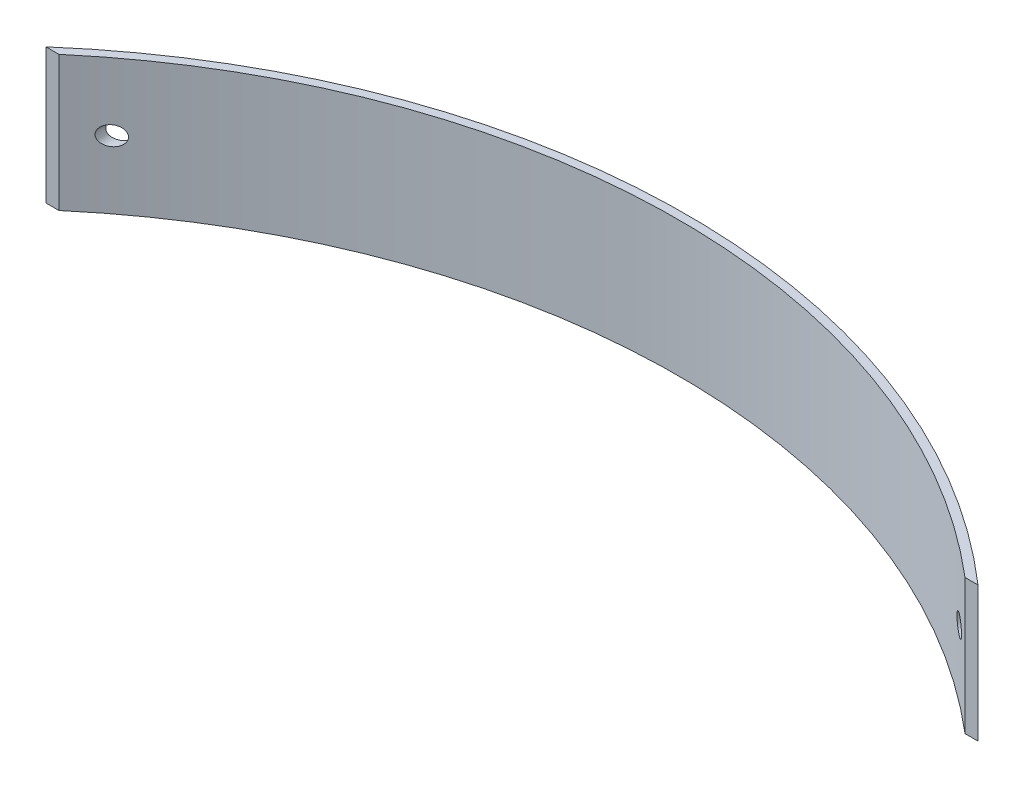
ISO-10303-21;
HEADER;
FILE_DESCRIPTION(('STEP AP214'),'2;1');
FILE_NAME('part.step','',(''),(''),'','','');
FILE_SCHEMA(('AUTOMOTIVE_DESIGN { 1 0 10303 214 1 1 1 1 }'));
ENDSEC;
DATA;
#1=APPLICATION_CONTEXT('core data for automotive mechanical design processes');
#2=APPLICATION_PROTOCOL_DEFINITION('international standard','automotive_design',2000,#1);
#3=PRODUCT_CONTEXT('',#1,'mechanical');
#4=PRODUCT('Part','Part','',(#3));
#5=PRODUCT_RELATED_PRODUCT_CATEGORY('part','',(#4));
#6=PRODUCT_DEFINITION_FORMATION('','',#4);
#7=PRODUCT_DEFINITION_CONTEXT('part definition',#1,'design');
#8=PRODUCT_DEFINITION('design','',#6,#7);
#9=PRODUCT_DEFINITION_SHAPE('','',#8);
#10=(LENGTH_UNIT() NAMED_UNIT(*) SI_UNIT(.MILLI.,.METRE.));
#11=(NAMED_UNIT(*) PLANE_ANGLE_UNIT() SI_UNIT($,.RADIAN.));
#12=(NAMED_UNIT(*) SI_UNIT($,.STERADIAN.) SOLID_ANGLE_UNIT());
#13=UNCERTAINTY_MEASURE_WITH_UNIT(LENGTH_MEASURE(1.E-05),#10,'distance_accuracy_value','');
#14=(GEOMETRIC_REPRESENTATION_CONTEXT(3) GLOBAL_UNCERTAINTY_ASSIGNED_CONTEXT((#13)) GLOBAL_UNIT_ASSIGNED_CONTEXT((#10,
#11,#12)) REPRESENTATION_CONTEXT('',''));
#15=CARTESIAN_POINT('',(0.,0.,0.));
#16=DIRECTION('',(0.,0.,1.));
#17=DIRECTION('',(1.,0.,0.));
#18=AXIS2_PLACEMENT_3D('',#15,#16,#17);
#19=CARTESIAN_POINT('',(0.,50.8,200.014733840304));
#20=DIRECTION('',(0.,-1.,0.));
#21=DIRECTION('',(0.,0.,-1.));
#22=AXIS2_PLACEMENT_3D('',#19,#20,#21);
#23=CYLINDRICAL_SURFACE('',#22,265.764733840304);
#24=CARTESIAN_POINT('',(-155.5563,25.4,-15.4687487831157));
#25=CARTESIAN_POINT('',(-155.556300492666,25.4864564692822,-15.4687484361435));
#26=CARTESIAN_POINT('',(-155.559446786538,25.5729224052767,-15.4664772432667));
#27=CARTESIAN_POINT('',(-155.571983694634,25.7451960852808,-15.457426079964));
#28=CARTESIAN_POINT('',(-155.58137727593,25.8310034969352,-15.4506439671327));
#29=CARTESIAN_POINT('',(-155.606283492095,26.0013933947019,-15.432657715201));
#30=CARTESIAN_POINT('',(-155.621805379908,26.085973827096,-15.4214468893071));
#31=CARTESIAN_POINT('',(-155.658724549251,26.2531706444461,-15.3947732347221));
#32=CARTESIAN_POINT('',(-155.680124303861,26.3357861867521,-15.3793086162676));
#33=CARTESIAN_POINT('',(-155.752461644528,26.5789994609958,-15.3270131683004));
#34=CARTESIAN_POINT('',(-155.811686256816,26.7359513991203,-15.2841733427863));
#35=CARTESIAN_POINT('',(-155.949204960864,27.0362440782479,-15.1845839671425));
#36=CARTESIAN_POINT('',(-156.027497151094,27.1795861745238,-15.1278358040294));
#37=CARTESIAN_POINT('',(-156.205736558126,27.459829959612,-14.9984622871658));
#38=CARTESIAN_POINT('',(-156.306784595407,27.5956534861338,-14.9250268760451));
#39=CARTESIAN_POINT('',(-156.523210906955,27.8482705064177,-14.767472448579));
#40=CARTESIAN_POINT('',(-156.638595948182,27.9650549532915,-14.6833483868441));
#41=CARTESIAN_POINT('',(-156.902187399731,28.1983951157675,-14.4908103017378));
#42=CARTESIAN_POINT('',(-157.052564861298,28.3111340074402,-14.3807485496445));
#43=CARTESIAN_POINT('',(-157.364227979453,28.5095803770905,-14.1520959166496));
#44=CARTESIAN_POINT('',(-157.525521002637,28.5952693744414,-14.0334992723045));
#45=CARTESIAN_POINT('',(-157.887385680177,28.7541272354172,-13.7667595049445));
#46=CARTESIAN_POINT('',(-158.089508142109,28.8216445149123,-13.6173470363156));
#47=CARTESIAN_POINT('',(-158.499017837631,28.9196797740796,-13.3136989502886));
#48=CARTESIAN_POINT('',(-158.706407966967,28.9501769330489,-13.1594606687472));
#49=CARTESIAN_POINT('',(-159.15348297875,28.9766232322297,-12.8259378606446));
#50=CARTESIAN_POINT('',(-159.393325509698,28.9666744820022,-12.6463811520886));
#51=CARTESIAN_POINT('',(-159.868420182092,28.8986527879862,-12.2894588696051));
#52=CARTESIAN_POINT('',(-160.103666730049,28.8405245393203,-12.1120960516041));
#53=CARTESIAN_POINT('',(-160.45197747964,28.7152298417313,-11.8486162937348));
#54=CARTESIAN_POINT('',(-160.569431902494,28.6658297950296,-11.7596087989371));
#55=CARTESIAN_POINT('',(-160.800096335792,28.5537513706271,-11.5845189804843));
#56=CARTESIAN_POINT('',(-160.913305564588,28.4910705615895,-11.4984371957981));
#57=CARTESIAN_POINT('',(-161.244318693007,28.2830098955333,-11.2463357140363));
#58=CARTESIAN_POINT('',(-161.454354103497,28.1173166327331,-11.0858193985319));
#59=CARTESIAN_POINT('',(-161.773777858908,27.7982781528683,-10.8410568501752));
#60=CARTESIAN_POINT('',(-161.892993788132,27.6601536121956,-10.7495220207073));
#61=CARTESIAN_POINT('',(-162.112072993346,27.3614202027077,-10.5810602715374));
#62=CARTESIAN_POINT('',(-162.211963761239,27.2008438428177,-10.5041126033775));
#63=CARTESIAN_POINT('',(-162.374144053838,26.8850391089569,-10.3790399451032));
#64=CARTESIAN_POINT('',(-162.439818724271,26.7325801188572,-10.3283285140612));
#65=CARTESIAN_POINT('',(-162.550145156982,26.4159014512975,-10.2430815853404));
#66=CARTESIAN_POINT('',(-162.594805810235,26.2516867815788,-10.2085392465932));
#67=CARTESIAN_POINT('',(-162.660525032129,25.9149949685959,-10.157693302861));
#68=CARTESIAN_POINT('',(-162.681475097475,25.7424835773995,-10.1414735454531));
#69=CARTESIAN_POINT('',(-162.697916353254,25.3955346410063,-10.1287454653869));
#70=CARTESIAN_POINT('',(-162.693414119396,25.2210976049304,-10.1322320515121));
#71=CARTESIAN_POINT('',(-162.660681619083,24.8900724834298,-10.1575686943075));
#72=CARTESIAN_POINT('',(-162.634375097146,24.7331715190418,-10.1779299227368));
#73=CARTESIAN_POINT('',(-162.562059274487,24.4268503459314,-10.2338635555199));
#74=CARTESIAN_POINT('',(-162.516047934352,24.2774309133224,-10.2694375343653));
#75=CARTESIAN_POINT('',(-162.404435624024,23.9834418755384,-10.3556494755955));
#76=CARTESIAN_POINT('',(-162.338125003609,23.8393049999766,-10.4068328356218));
#77=CARTESIAN_POINT('',(-162.189615370314,23.5647482122951,-10.5213229337172));
#78=CARTESIAN_POINT('',(-162.107409790609,23.4343340040479,-10.5846346823937));
#79=CARTESIAN_POINT('',(-161.916580272964,23.1699494351776,-10.7313961842545));
#80=CARTESIAN_POINT('',(-161.805842305563,23.0383987162258,-10.8164427082473));
#81=CARTESIAN_POINT('',(-161.570910341664,22.7958298323173,-10.9965375229457));
#82=CARTESIAN_POINT('',(-161.446707923368,22.6848246371312,-11.091592072428));
#83=CARTESIAN_POINT('',(-161.161478709977,22.4627587610552,-11.3094481482125));
#84=CARTESIAN_POINT('',(-160.998122627716,22.3563520324495,-11.4339430549538));
#85=CARTESIAN_POINT('',(-160.660974350382,22.1730390169892,-11.690226072897));
#86=CARTESIAN_POINT('',(-160.487175675265,22.0961512711188,-11.8220187085676));
#87=CARTESIAN_POINT('',(-160.097768450278,21.9590818243874,-12.1165200342316));
#88=CARTESIAN_POINT('',(-159.880671534095,21.9051808337523,-12.2802019047199));
#89=CARTESIAN_POINT('',(-159.441864153305,21.8384641548132,-12.6099618925717));
#90=CARTESIAN_POINT('',(-159.220149581453,21.8256867656299,-12.7760420990688));
#91=CARTESIAN_POINT('',(-158.751194387016,21.8423080284962,-13.1261753906039));
#92=CARTESIAN_POINT('',(-158.503992527412,21.8767994449852,-13.3100655519136));
#93=CARTESIAN_POINT('',(-158.017366154692,21.9982978100167,-13.6707763749566));
#94=CARTESIAN_POINT('',(-157.777937143611,22.0852737948156,-13.8476011394545));
#95=CARTESIAN_POINT('',(-157.363544564114,22.289586124258,-14.1526321460489));
#96=CARTESIAN_POINT('',(-157.185484725904,22.396932559173,-14.2833336145913));
#97=CARTESIAN_POINT('',(-156.845561756746,22.6460794955391,-14.532248645129));
#98=CARTESIAN_POINT('',(-156.683675260801,22.7878292493003,-14.6504802360473));
#99=CARTESIAN_POINT('',(-156.410288650231,23.0766498310313,-14.8497319279844));
#100=CARTESIAN_POINT('',(-156.294975686438,23.2180895782195,-14.9336115263799));
#101=CARTESIAN_POINT('',(-156.137149340289,23.4462970402347,-15.0482536992376));
#102=CARTESIAN_POINT('',(-156.087036354541,23.5250981315405,-15.0846251854042));
#103=CARTESIAN_POINT('',(-155.992490168601,23.6877392235462,-15.1532009618243));
#104=CARTESIAN_POINT('',(-155.948054425475,23.7715769433381,-15.1854071178804));
#105=CARTESIAN_POINT('',(-155.86508973304,23.9446969849035,-15.2455044969062));
#106=CARTESIAN_POINT('',(-155.826620958973,24.0340234927756,-15.2733517846434));
#107=CARTESIAN_POINT('',(-155.756750105186,24.2167536063644,-15.3239073981989));
#108=CARTESIAN_POINT('',(-155.72534409599,24.310154910295,-15.3466185816062));
#109=CARTESIAN_POINT('',(-155.670210734014,24.5001063572186,-15.386474140777));
#110=CARTESIAN_POINT('',(-155.646465285017,24.5966484774319,-15.4036316361079));
#111=CARTESIAN_POINT('',(-155.607035343177,24.7921551101235,-15.4321155237584));
#112=CARTESIAN_POINT('',(-155.591345036641,24.8911178213742,-15.4434461215747));
#113=CARTESIAN_POINT('',(-155.572017298791,25.0585455414479,-15.4574018856646));
#114=CARTESIAN_POINT('',(-155.566129087184,25.1266270651358,-15.4616529326963));
#115=CARTESIAN_POINT('',(-155.558270215159,25.2631370788442,-15.4673265387036));
#116=CARTESIAN_POINT('',(-155.556299610031,25.3315655737478,-15.4687490577609));
#117=CARTESIAN_POINT('',(-155.5563,25.4,-15.4687487831157));
#118=B_SPLINE_CURVE_WITH_KNOTS('',3,(#24,#25,#26,#27,#28,#29,#30,#31,#32,#33,#34,#35,#36,#37,
#38,#39,#40,#41,#42,#43,#44,#45,#46,#47,#48,#49,#50,#51,#52,#53,#54,#55,#56,#57,#58,#59,#60,#61,
#62,#63,#64,#65,#66,#67,#68,#69,#70,#71,#72,#73,#74,#75,#76,#77,#78,#79,#80,#81,#82,#83,#84,#85,
#86,#87,#88,#89,#90,#91,#92,#93,#94,#95,#96,#97,#98,#99,#100,#101,#102,#103,#104,#105,#106,#107,
#108,#109,#110,#111,#112,#113,#114,#115,#116,#117),.UNSPECIFIED.,.T.,.F.,(4,2,2,2,2,2,2,2,2,2,2,
2,2,2,2,2,2,2,2,2,2,2,2,2,2,2,2,2,2,2,2,2,2,2,2,2,2,2,2,2,2,2,2,2,2,2,4),(0.,0.259298852428746,
0.518720943653179,0.778536235591699,1.03846101125444,1.55533628106842,2.07216002616851,
2.62367524419849,3.17545176922404,3.8264414478295,4.47787492814438,5.25565357950205,
6.03386946353912,6.92934288473446,7.82584563889977,8.29153900441598,8.75731769915866,
9.68561909421689,10.2958577362315,10.9052217663629,11.4237722356739,11.9421031099217,
12.4627964747997,12.9833553225138,13.4623399920412,13.9413742475995,14.4395603335233,
14.9379526809178,15.5113660338727,16.0851401399365,16.7765421475802,17.4683777197118,
18.2965885340557,19.1255704525856,20.0512359372384,20.9763558503827,21.7102760220899,
22.4431201122269,23.0430078676668,23.3433483088423,23.6435537472012,23.9466133771497,
24.2495039758362,24.5516737387079,24.8536251068479,25.0588696410689,25.2641170718412),.UNSPECIFIED.);
#119=CARTESIAN_POINT('',(-155.5563,25.4,-15.4687487831157));
#120=VERTEX_POINT('',#119);
#121=EDGE_CURVE('E112',#120,#120,#118,.T.);
#122=ORIENTED_EDGE('',*,*,#121,.T.);
#123=EDGE_LOOP('',(#122));
#124=FACE_BOUND('',#123,.T.);
#125=CARTESIAN_POINT('',(162.6937,25.4,-10.1320094928194));
#126=CARTESIAN_POINT('',(162.693699245937,25.4852136226089,-10.1320100892481));
#127=CARTESIAN_POINT('',(162.69064181965,25.5704570795435,-10.1343772186137));
#128=CARTESIAN_POINT('',(162.678460679064,25.7402858919881,-10.1438068893375));
#129=CARTESIAN_POINT('',(162.669332922172,25.8248707709083,-10.1508725597328));
#130=CARTESIAN_POINT('',(162.645134688458,25.9928601149926,-10.1695999018299));
#131=CARTESIAN_POINT('',(162.630051725757,26.0762617161893,-10.1812712298763));
#132=CARTESIAN_POINT('',(162.594193456593,26.241098791274,-10.2090101004298));
#133=CARTESIAN_POINT('',(162.573415646384,26.3225333831884,-10.2250795765836));
#134=CARTESIAN_POINT('',(162.503263482506,26.5620925451817,-10.2793141444987));
#135=CARTESIAN_POINT('',(162.445903710549,26.7165907698346,-10.3236345630558));
#136=CARTESIAN_POINT('',(162.31291107315,27.0121988836582,-10.4262784692646));
#137=CARTESIAN_POINT('',(162.237282630807,27.1533120020496,-10.4845985673778));
#138=CARTESIAN_POINT('',(162.064578976684,27.4305468718906,-10.617596807874));
#139=CARTESIAN_POINT('',(161.966317560002,27.5654924321081,-10.6931760934792));
#140=CARTESIAN_POINT('',(161.755829103812,27.8168748270165,-10.8548067284649));
#141=CARTESIAN_POINT('',(161.643594583981,27.933301671336,-10.9408636863846));
#142=CARTESIAN_POINT('',(161.384594728012,28.1688110798481,-11.1390913839909));
#143=CARTESIAN_POINT('',(161.23541831436,28.283743646067,-11.2530380286849));
#144=CARTESIAN_POINT('',(160.92566872208,28.486673175199,-11.489074476135));
#145=CARTESIAN_POINT('',(160.76508753519,28.5746509758575,-11.6111699972134));
#146=CARTESIAN_POINT('',(160.402132565467,28.7394630337586,-11.8864494058149));
#147=CARTESIAN_POINT('',(160.197954062271,28.8102875257454,-12.040864034326));
#148=CARTESIAN_POINT('',(159.78307937201,28.9140176416979,-12.3536464664809));
#149=CARTESIAN_POINT('',(159.572379272526,28.9469000323587,-12.5120166316754));
#150=CARTESIAN_POINT('',(159.118348129171,28.9769455647487,-12.8522118086058));
#151=CARTESIAN_POINT('',(158.874687218006,28.9682834280599,-13.0341304244514));
#152=CARTESIAN_POINT('',(158.390778706779,28.9008870566673,-13.3941361946683));
#153=CARTESIAN_POINT('',(158.150534814394,28.8421021084002,-13.5722192811389));
#154=CARTESIAN_POINT('',(157.797184513167,28.714894599474,-13.8332598990207));
#155=CARTESIAN_POINT('',(157.67971625443,28.6654653145265,-13.9198857488635));
#156=CARTESIAN_POINT('',(157.448807491836,28.5531688668856,-14.0898837139325));
#157=CARTESIAN_POINT('',(157.335367638755,28.4902995444165,-14.1732553036588));
#158=CARTESIAN_POINT('',(157.114164662105,28.3511344026345,-14.3355677771061));
#159=CARTESIAN_POINT('',(157.006388514062,28.2748713128223,-14.414518856503));
#160=CARTESIAN_POINT('',(156.79776809246,28.1087614903726,-14.5671162438067));
#161=CARTESIAN_POINT('',(156.696923155325,28.0189160607119,-14.6407630595611));
#162=CARTESIAN_POINT('',(156.473504824616,27.7952905962705,-14.8037026168278));
#163=CARTESIAN_POINT('',(156.354068241424,27.6565784995289,-14.89063465786));
#164=CARTESIAN_POINT('',(156.13487125459,27.3568121487672,-15.0499404615793));
#165=CARTESIAN_POINT('',(156.035099121012,27.1957713122113,-15.1223229036854));
#166=CARTESIAN_POINT('',(155.903745086743,26.9390042076707,-15.2175104877836));
#167=CARTESIAN_POINT('',(155.862861245274,26.8504233562613,-15.2471168730327));
#168=CARTESIAN_POINT('',(155.788064667779,26.668896407007,-15.3012543911594));
#169=CARTESIAN_POINT('',(155.75414815097,26.5759527104566,-15.3257882766494));
#170=CARTESIAN_POINT('',(155.693899466275,26.3864354505437,-15.3693528699214));
#171=CARTESIAN_POINT('',(155.667563792033,26.2898635887545,-15.3883861219208));
#172=CARTESIAN_POINT('',(155.622974325063,26.0939195600983,-15.4206030366948));
#173=CARTESIAN_POINT('',(155.604719133932,25.9945478809349,-15.4337877116219));
#174=CARTESIAN_POINT('',(155.578591468334,25.8077346237352,-15.4526554557406));
#175=CARTESIAN_POINT('',(155.569640299435,25.7205205906891,-15.4591179823355));
#176=CARTESIAN_POINT('',(155.558184495293,25.5454183599035,-15.4673884821369));
#177=CARTESIAN_POINT('',(155.555681905288,25.4575299571423,-15.4691949786308));
#178=CARTESIAN_POINT('',(155.557175115424,25.2818989015364,-15.468117046165));
#179=CARTESIAN_POINT('',(155.561166059185,25.1941561888514,-15.4652361228292));
#180=CARTESIAN_POINT('',(155.575561927167,25.0194650673495,-15.4548425599107));
#181=CARTESIAN_POINT('',(155.58596922515,24.9325169645891,-15.4473282061677));
#182=CARTESIAN_POINT('',(155.624697968064,24.6860358013378,-15.4193585377592));
#183=CARTESIAN_POINT('',(155.660728285665,24.5282513754788,-15.3933316646044));
#184=CARTESIAN_POINT('',(155.752569370324,24.2218754976149,-15.3269343237634));
#185=CARTESIAN_POINT('',(155.80838246059,24.0732851277314,-15.2865621714238));
#186=CARTESIAN_POINT('',(155.940969751013,23.7798288878737,-15.1905513130081));
#187=CARTESIAN_POINT('',(156.018767258678,23.6356721469272,-15.1341663788771));
#188=CARTESIAN_POINT('',(156.190398221231,23.362907447436,-15.00960081592));
#189=CARTESIAN_POINT('',(156.284238824455,23.2343064638882,-14.9414149287658));
#190=CARTESIAN_POINT('',(156.499661872218,22.9760564915152,-14.7846371889015));
#191=CARTESIAN_POINT('',(156.623294618712,22.8490507880315,-14.6945189255505));
#192=CARTESIAN_POINT('',(156.883454779228,22.6176526196535,-14.5044992784941));
#193=CARTESIAN_POINT('',(157.019989942586,22.5132738703178,-14.4045920140592));
#194=CARTESIAN_POINT('',(157.329591026274,22.3092470467968,-14.1775559269125));
#195=CARTESIAN_POINT('',(157.504643997803,22.2143370576625,-14.0488790769045));
#196=CARTESIAN_POINT('',(157.863378214224,22.0559858564393,-13.7844648761513));
#197=CARTESIAN_POINT('',(158.047064506139,21.9925633087617,-13.648723390329));
#198=CARTESIAN_POINT('',(158.4531292099,21.887763555554,-13.3478082696141));
#199=CARTESIAN_POINT('',(158.676462388014,21.8525038541222,-13.1817762525069));
#200=CARTESIAN_POINT('',(159.124437651986,21.824239300595,-12.8476286970899));
#201=CARTESIAN_POINT('',(159.349080794914,21.8312753512156,-12.6795112988824));
#202=CARTESIAN_POINT('',(159.818232265296,21.8904771283071,-12.3272572820298));
#203=CARTESIAN_POINT('',(160.062311991409,21.9473635617491,-12.1433188187943));
#204=CARTESIAN_POINT('',(160.538316293064,22.1134209394241,-11.783357643779));
#205=CARTESIAN_POINT('',(160.770249920349,22.2225523153889,-11.6073290515547));
#206=CARTESIAN_POINT('',(161.160931671954,22.4622956290189,-11.3098824413623));
#207=CARTESIAN_POINT('',(161.324087774189,22.5818693472857,-11.1853380485002));
#208=CARTESIAN_POINT('',(161.632618207501,22.8525553979814,-10.9493105512621));
#209=CARTESIAN_POINT('',(161.77802066863,23.0036167832943,-10.8378067965675));
#210=CARTESIAN_POINT('',(162.019292881887,23.3051197467574,-10.6524471437526));
#211=CARTESIAN_POINT('',(162.119327815182,23.4502558701291,-10.5754609625938));
#212=CARTESIAN_POINT('',(162.254210207974,23.6819541491004,-10.4715323750776));
#213=CARTESIAN_POINT('',(162.296667134204,23.7615800761161,-10.4387957126772));
#214=CARTESIAN_POINT('',(162.375952474478,23.9251521661302,-10.3776289346214));
#215=CARTESIAN_POINT('',(162.412783420548,24.0090963627764,-10.3491968816877));
#216=CARTESIAN_POINT('',(162.480599770519,24.1817008132552,-10.2968214976127));
#217=CARTESIAN_POINT('',(162.511524420844,24.2703991897149,-10.2729248327905));
#218=CARTESIAN_POINT('',(162.566522940078,24.4510801816489,-10.2304101748632));
#219=CARTESIAN_POINT('',(162.590600641432,24.543060927301,-10.2117892287994));
#220=CARTESIAN_POINT('',(162.631403856891,24.729316050867,-10.1802254186477));
#221=CARTESIAN_POINT('',(162.648149809081,24.8235832696281,-10.1672667704644));
#222=CARTESIAN_POINT('',(162.674027601899,25.0137197644001,-10.1472388581829));
#223=CARTESIAN_POINT('',(162.683166150771,25.1095875527527,-10.1401644053797));
#224=CARTESIAN_POINT('',(162.690172024871,25.2380767027701,-10.1347407769268));
#225=CARTESIAN_POINT('',(162.691494443558,25.2704371423347,-10.1337169985778));
#226=CARTESIAN_POINT('',(162.693258576264,25.3351969498065,-10.1323512417539));
#227=CARTESIAN_POINT('',(162.693700286743,25.3675963178697,-10.132009266019));
#228=CARTESIAN_POINT('',(162.6937,25.4,-10.1320094928194));
#229=B_SPLINE_CURVE_WITH_KNOTS('',3,(#125,#126,#127,#128,#129,#130,#131,#132,#133,#134,#135,
#136,#137,#138,#139,#140,#141,#142,#143,#144,#145,#146,#147,#148,#149,#150,#151,#152,#153,#154,
#155,#156,#157,#158,#159,#160,#161,#162,#163,#164,#165,#166,#167,#168,#169,#170,#171,#172,#173,
#174,#175,#176,#177,#178,#179,#180,#181,#182,#183,#184,#185,#186,#187,#188,#189,#190,#191,#192,
#193,#194,#195,#196,#197,#198,#199,#200,#201,#202,#203,#204,#205,#206,#207,#208,#209,#210,#211,
#212,#213,#214,#215,#216,#217,#218,#219,#220,#221,#222,#223,#224,#225,#226,#227,#228),
.UNSPECIFIED.,.T.,.F.,(4,2,2,2,2,2,2,2,2,2,2,2,2,2,2,2,2,2,2,2,2,2,2,2,2,2,2,2,2,2,2,2,2,2,2,2,
2,2,2,2,2,2,2,2,2,2,2,2,2,2,2,4),(0.,0.255605063857056,0.51138052098361,0.767695117563953,
1.02412258442893,1.5336082625508,2.04297071051879,2.59069236675358,3.13870850984781,
3.79662779352651,4.45501371526427,5.24875976767398,6.04299160166185,6.95159031202915,
7.86110942230629,8.32285071072205,8.7846662555025,9.24536860645058,9.70602678944968,
10.3115156982943,10.9166423297324,11.2221213857489,11.5274342347046,11.8326056399422,
12.137724211715,12.4011042152794,12.6645677425158,12.9278343214094,13.191198355541,
13.6805921854027,14.1700435067626,14.6877250274861,15.2056378160436,15.7999426141569,
16.3946066550453,17.1032068019216,17.8122264767182,18.6503575287447,19.4892992377788,
20.4174767400486,21.3449523865496,22.0549367039177,22.7637810601924,23.3383212401001,
23.6259954773304,23.9135398601793,24.2038991137911,24.4940955231503,24.7834777448856,
25.0726045169679,25.1698015577641,25.2669989891904),.UNSPECIFIED.);
#230=CARTESIAN_POINT('',(162.6937,25.4,-10.1320094928194));
#231=VERTEX_POINT('',#230);
#232=EDGE_CURVE('E123',#231,#231,#229,.T.);
#233=ORIENTED_EDGE('',*,*,#232,.T.);
#234=EDGE_LOOP('',(#233));
#235=FACE_BOUND('',#234,.T.);
#236=CARTESIAN_POINT('',(0.,0.,200.014733840304));
#237=DIRECTION('',(0.,1.,0.));
#238=DIRECTION('',(0.,0.,1.));
#239=AXIS2_PLACEMENT_3D('',#236,#237,#238);
#240=CIRCLE('',#239,265.764733840304);
#241=CARTESIAN_POINT('',(175.,0.,0.));
#242=VERTEX_POINT('',#241);
#243=CARTESIAN_POINT('',(-175.,0.,0.));
#244=VERTEX_POINT('',#243);
#245=EDGE_CURVE('E109',#242,#244,#240,.T.);
#246=ORIENTED_EDGE('',*,*,#245,.T.);
#247=DIRECTION('',(0.,-1.,0.));
#248=VECTOR('',#247,1.);
#249=CARTESIAN_POINT('',(-175.,50.8,0.));
#250=LINE('',#249,#248);
#251=CARTESIAN_POINT('',(-175.,50.8,0.));
#252=VERTEX_POINT('',#251);
#253=EDGE_CURVE('E11',#252,#244,#250,.T.);
#254=ORIENTED_EDGE('',*,*,#253,.F.);
#255=CARTESIAN_POINT('',(0.,50.8,200.014733840304));
#256=DIRECTION('',(0.,1.,0.));
#257=DIRECTION('',(0.,0.,1.));
#258=AXIS2_PLACEMENT_3D('',#255,#256,#257);
#259=CIRCLE('',#258,265.764733840304);
#260=CARTESIAN_POINT('',(175.,50.8,0.));
#261=VERTEX_POINT('',#260);
#262=EDGE_CURVE('E96',#261,#252,#259,.T.);
#263=ORIENTED_EDGE('',*,*,#262,.F.);
#264=DIRECTION('',(0.,-1.,0.));
#265=VECTOR('',#264,1.);
#266=CARTESIAN_POINT('',(175.,50.8,0.));
#267=LINE('',#266,#265);
#268=EDGE_CURVE('E105',#261,#242,#267,.T.);
#269=ORIENTED_EDGE('',*,*,#268,.T.);
#270=EDGE_LOOP('',(#246,#254,#263,#269));
#271=FACE_BOUND('',#270,.T.);
#272=ADVANCED_FACE('F37',(#124,#235,#271),#23,.T.);
#273=CARTESIAN_POINT('',(-175.,50.8,0.));
#274=DIRECTION('',(0.,0.,-1.));
#275=DIRECTION('',(-1.,0.,0.));
#276=AXIS2_PLACEMENT_3D('',#273,#274,#275);
#277=PLANE('',#276);
#278=DIRECTION('',(1.,0.,0.));
#279=VECTOR('',#278,1.);
#280=CARTESIAN_POINT('',(-175.,0.,0.));
#281=LINE('',#280,#279);
#282=CARTESIAN_POINT('',(-170.139573777279,0.,0.));
#283=VERTEX_POINT('',#282);
#284=EDGE_CURVE('E100',#244,#283,#281,.T.);
#285=ORIENTED_EDGE('',*,*,#284,.T.);
#286=DIRECTION('',(0.,-1.,0.));
#287=VECTOR('',#286,1.);
#288=CARTESIAN_POINT('',(-170.139573777279,50.8,0.));
#289=LINE('',#288,#287);
#290=CARTESIAN_POINT('',(-170.139573777279,50.8,0.));
#291=VERTEX_POINT('',#290);
#292=EDGE_CURVE('E52',#291,#283,#289,.T.);
#293=ORIENTED_EDGE('',*,*,#292,.F.);
#294=DIRECTION('',(1.,0.,0.));
#295=VECTOR('',#294,1.);
#296=CARTESIAN_POINT('',(-175.,50.8,0.));
#297=LINE('',#296,#295);
#298=EDGE_CURVE('E91',#252,#291,#297,.T.);
#299=ORIENTED_EDGE('',*,*,#298,.F.);
#300=ORIENTED_EDGE('',*,*,#253,.T.);
#301=EDGE_LOOP('',(#285,#293,#299,#300));
#302=FACE_BOUND('',#301,.T.);
#303=ADVANCED_FACE('F99',(#302),#277,.F.);
#304=CARTESIAN_POINT('',(0.,50.8,200.014733840304));
#305=DIRECTION('',(0.,-1.,0.));
#306=DIRECTION('',(0.,0.,-1.));
#307=AXIS2_PLACEMENT_3D('',#304,#305,#306);
#308=CYLINDRICAL_SURFACE('',#307,262.589733840304);
#309=CARTESIAN_POINT('',(-155.5563,25.4,-11.5404737264957));
#310=CARTESIAN_POINT('',(-155.556300391423,25.3138989229646,-11.5404734457268));
#311=CARTESIAN_POINT('',(-155.559420919178,25.2277907062911,-11.5381790267652));
#312=CARTESIAN_POINT('',(-155.571853955545,25.0562331752761,-11.5290361774238));
#313=CARTESIAN_POINT('',(-155.581169291348,24.9707841798112,-11.5221856677321));
#314=CARTESIAN_POINT('',(-155.605864467203,24.8011172638649,-11.504020641927));
#315=CARTESIAN_POINT('',(-155.621253083021,24.7169013085447,-11.4926996660673));
#316=CARTESIAN_POINT('',(-155.657849662648,24.5504310033755,-11.4657680216238));
#317=CARTESIAN_POINT('',(-155.679060081336,24.4681774969714,-11.4501555434369));
#318=CARTESIAN_POINT('',(-155.750740844239,24.2260522777067,-11.3973722092994));
#319=CARTESIAN_POINT('',(-155.809410603177,24.0698183828556,-11.3541453522232));
#320=CARTESIAN_POINT('',(-155.945583803281,23.7708943569041,-11.2536980696423));
#321=CARTESIAN_POINT('',(-156.023085886703,23.6282032504472,-11.1964786529501));
#322=CARTESIAN_POINT('',(-156.199570775486,23.3490061023876,-11.065997691018));
#323=CARTESIAN_POINT('',(-156.299660893403,23.2135921962748,-10.9919060934414));
#324=CARTESIAN_POINT('',(-156.513972699699,22.9616484486538,-10.8329896164351));
#325=CARTESIAN_POINT('',(-156.628201020513,22.8451275297779,-10.7481596990773));
#326=CARTESIAN_POINT('',(-156.88968122735,22.6116135985726,-10.553609909623));
#327=CARTESIAN_POINT('',(-157.039135347622,22.4985103581723,-10.4421870556301));
#328=CARTESIAN_POINT('',(-157.348863150796,22.2992048078171,-10.2107191203154));
#329=CARTESIAN_POINT('',(-157.509144283407,22.2130212545149,-10.0906680985275));
#330=CARTESIAN_POINT('',(-157.869669662587,22.0524513628489,-9.81995353199948));
#331=CARTESIAN_POINT('',(-158.071503160879,21.983856698817,-9.66796384793398));
#332=CARTESIAN_POINT('',(-158.480472285935,21.8836696141186,-9.35903258360957));
#333=CARTESIAN_POINT('',(-158.68761084567,21.8520981340278,-9.20208825244827));
#334=CARTESIAN_POINT('',(-159.135405097574,21.8232107236831,-8.86174158919108));
#335=CARTESIAN_POINT('',(-159.376239403087,21.8320199116958,-8.67803781634805));
#336=CARTESIAN_POINT('',(-159.853469462544,21.8981392606726,-8.31271733486878));
#337=CARTESIAN_POINT('',(-160.089859476523,21.955508256243,-8.13110342896752));
#338=CARTESIAN_POINT('',(-160.440407625099,22.08012819722,-7.86087096600015));
#339=CARTESIAN_POINT('',(-160.558887522982,22.1294892689969,-7.76936934502819));
#340=CARTESIAN_POINT('',(-160.791613078835,22.2417180923242,-7.58932967663331));
#341=CARTESIAN_POINT('',(-160.905857911937,22.3045884590562,-7.50079220686331));
#342=CARTESIAN_POINT('',(-161.239948100134,22.5135951840851,-7.24145068060899));
#343=CARTESIAN_POINT('',(-161.452028499096,22.6804298892151,-7.07623910993126));
#344=CARTESIAN_POINT('',(-161.772832537406,23.0007327515171,-6.82565166737079));
#345=CARTESIAN_POINT('',(-161.891685568973,23.1382921322374,-6.73262382263252));
#346=CARTESIAN_POINT('',(-162.110302996597,23.4359408745885,-6.56125005786404));
#347=CARTESIAN_POINT('',(-162.210094973148,23.5959970927427,-6.48288292786881));
#348=CARTESIAN_POINT('',(-162.372019030859,23.9104251456013,-6.35557597183772));
#349=CARTESIAN_POINT('',(-162.437572154163,24.0619493078733,-6.30397200561944));
#350=CARTESIAN_POINT('',(-162.547943209532,24.3768409189437,-6.21702762304444));
#351=CARTESIAN_POINT('',(-162.592770128366,24.5402031991907,-6.18168015799372));
#352=CARTESIAN_POINT('',(-162.659073064844,24.8753578722713,-6.12938106101135));
#353=CARTESIAN_POINT('',(-162.680436888979,25.0471866990091,-6.11251781583845));
#354=CARTESIAN_POINT('',(-162.697883349617,25.392911436645,-6.09874756252335));
#355=CARTESIAN_POINT('',(-162.693973058829,25.5668067556606,-6.10183497139004));
#356=CARTESIAN_POINT('',(-162.662566533801,25.8963460179914,-6.12662077658199));
#357=CARTESIAN_POINT('',(-162.637056061185,26.0523063388451,-6.14675225252238));
#358=CARTESIAN_POINT('',(-162.566576546705,26.3568774036878,-6.20233262746167));
#359=CARTESIAN_POINT('',(-162.521605443491,26.5054873672377,-6.23778314911669));
#360=CARTESIAN_POINT('',(-162.412372294781,26.7979019359634,-6.32380989385904));
#361=CARTESIAN_POINT('',(-162.347419206887,26.9412856841583,-6.37492765676885));
#362=CARTESIAN_POINT('',(-162.201857111391,27.2145445638212,-6.48934464249953));
#363=CARTESIAN_POINT('',(-162.121241615044,27.3444140621382,-6.55264891394317));
#364=CARTESIAN_POINT('',(-161.933788365124,27.6082521854018,-6.69964091708715));
#365=CARTESIAN_POINT('',(-161.82482500848,27.7397907588394,-6.78496589893547));
#366=CARTESIAN_POINT('',(-161.593587541634,27.9826060685128,-6.96570574194252));
#367=CARTESIAN_POINT('',(-161.471304996647,28.0938698445088,-7.06112699576886));
#368=CARTESIAN_POINT('',(-161.189741797769,28.3173966556965,-7.28040246217075));
#369=CARTESIAN_POINT('',(-161.028089516652,28.4249459136199,-7.40601520940462));
#370=CARTESIAN_POINT('',(-160.69434136534,28.610814071073,-7.66468663637404));
#371=CARTESIAN_POINT('',(-160.522238932556,28.689114377169,-7.79774999084506));
#372=CARTESIAN_POINT('',(-160.135256713911,28.830103804703,-8.09614755750123));
#373=CARTESIAN_POINT('',(-159.918816687846,28.8863425547846,-8.2625241502108));
#374=CARTESIAN_POINT('',(-159.481080364088,28.9578192563161,-8.59789655320099));
#375=CARTESIAN_POINT('',(-159.259779634227,28.9730180763303,-8.76689470886074));
#376=CARTESIAN_POINT('',(-158.789831139498,28.9616207314741,-9.12458647567556));
#377=CARTESIAN_POINT('',(-158.541181759653,28.9296303864837,-9.31313454269876));
#378=CARTESIAN_POINT('',(-158.051223073636,28.8126211999887,-9.68331878321696));
#379=CARTESIAN_POINT('',(-157.809909723262,28.727632152687,-9.8649587793822));
#380=CARTESIAN_POINT('',(-157.391841705995,28.5263225730991,-10.1785822964379));
#381=CARTESIAN_POINT('',(-157.212068506154,28.4201389042034,-10.3130579451285));
#382=CARTESIAN_POINT('',(-156.868444161355,28.1727752478343,-10.5694661686595));
#383=CARTESIAN_POINT('',(-156.704569630598,28.0316477807422,-10.6914171823112));
#384=CARTESIAN_POINT('',(-156.428225065443,27.7441335337838,-10.8966282539327));
#385=CARTESIAN_POINT('',(-156.311870920891,27.6036535672054,-10.9828604136834));
#386=CARTESIAN_POINT('',(-156.152266728971,27.3766298170266,-11.1009745486931));
#387=CARTESIAN_POINT('',(-156.101524728267,27.2981809830108,-11.1384945413907));
#388=CARTESIAN_POINT('',(-156.005660242684,27.1361418271393,-11.2093316312626));
#389=CARTESIAN_POINT('',(-155.960535221815,27.0525538511898,-11.24265062522));
#390=CARTESIAN_POINT('',(-155.876124371071,26.8797846517566,-11.304940947982));
#391=CARTESIAN_POINT('',(-155.836900599751,26.7905563483424,-11.3338660973342));
#392=CARTESIAN_POINT('',(-155.765500866896,26.6078878989055,-11.3864937483483));
#393=CARTESIAN_POINT('',(-155.733320921473,26.5144501699229,-11.4101992022404));
#394=CARTESIAN_POINT('',(-155.67664777637,26.3242873313966,-11.4519323111898));
#395=CARTESIAN_POINT('',(-155.6521364248,26.2275705947648,-11.4699733744674));
#396=CARTESIAN_POINT('',(-155.611208547101,26.0315833698227,-11.5000900914656));
#397=CARTESIAN_POINT('',(-155.59478620454,25.9323147706404,-11.5121700315657));
#398=CARTESIAN_POINT('',(-155.573850342769,25.7607651746528,-11.5275681225443));
#399=CARTESIAN_POINT('',(-155.567276172523,25.6888621016575,-11.5324025886835));
#400=CARTESIAN_POINT('',(-155.558500796919,25.5446410366199,-11.5388555378681));
#401=CARTESIAN_POINT('',(-155.556299671213,25.4723230370442,-11.5404739623356));
#402=CARTESIAN_POINT('',(-155.5563,25.4,-11.5404737264957));
#403=B_SPLINE_CURVE_WITH_KNOTS('',3,(#309,#310,#311,#312,#313,#314,#315,#316,#317,#318,#319,
#320,#321,#322,#323,#324,#325,#326,#327,#328,#329,#330,#331,#332,#333,#334,#335,#336,#337,#338,
#339,#340,#341,#342,#343,#344,#345,#346,#347,#348,#349,#350,#351,#352,#353,#354,#355,#356,#357,
#358,#359,#360,#361,#362,#363,#364,#365,#366,#367,#368,#369,#370,#371,#372,#373,#374,#375,#376,
#377,#378,#379,#380,#381,#382,#383,#384,#385,#386,#387,#388,#389,#390,#391,#392,#393,#394,#395,
#396,#397,#398,#399,#400,#401,#402),.UNSPECIFIED.,.T.,.F.,(4,2,2,2,2,2,2,2,2,2,2,2,2,2,2,2,2,2,
2,2,2,2,2,2,2,2,2,2,2,2,2,2,2,2,2,2,2,2,2,2,2,2,2,2,2,2,4),(0.,0.258228630020822,
0.516575191558628,0.775296433516383,1.0341269385698,1.54878356607567,2.06340309965613,
2.61325239261979,3.16336061247026,3.81509917687384,4.46729084107259,5.24970771954102,
6.03256692542857,6.93778160244952,7.84409460153053,8.31637285820781,8.78874262283759,
9.73007923688226,10.3405875340615,10.9502056476953,11.4669668406962,11.9835037582794,
12.5024999900791,13.0213509922622,13.4971118776774,13.972923169994,14.467505319544,
14.9622928070893,15.533019797129,16.1041103423605,16.7953406232156,17.4870095714323,
18.3198828623246,19.1535500151449,20.09018756716,21.0262990451099,21.7685010676008,
22.5095942639027,23.1122533222353,23.4139798587442,23.715569671817,24.0201375117784,
24.3245326448627,24.6282017128377,24.9316521065051,25.1485546036506,25.3654610514897),.UNSPECIFIED.);
#404=CARTESIAN_POINT('',(-155.5563,25.4,-11.5404737264957));
#405=VERTEX_POINT('',#404);
#406=EDGE_CURVE('E41',#405,#405,#403,.T.);
#407=ORIENTED_EDGE('',*,*,#406,.T.);
#408=EDGE_LOOP('',(#407));
#409=FACE_BOUND('',#408,.T.);
#410=CARTESIAN_POINT('',(162.6937,25.4,-6.10204931582756));
#411=CARTESIAN_POINT('',(162.693699221668,25.3151774822236,-6.1020499434272));
#412=CARTESIAN_POINT('',(162.690669806401,25.2303269378388,-6.104441243934));
#413=CARTESIAN_POINT('',(162.678601239548,25.0612848797147,-6.11396642755255));
#414=CARTESIAN_POINT('',(162.669558161463,24.9770938329437,-6.12110340926069));
#415=CARTESIAN_POINT('',(162.645588031297,24.8098967628947,-6.14001688471757));
#416=CARTESIAN_POINT('',(162.630648843976,24.726893551835,-6.15180294707338));
#417=CARTESIAN_POINT('',(162.595138453962,24.5628513879232,-6.17980967661024));
#418=CARTESIAN_POINT('',(162.574564764706,24.4818133195372,-6.19603230168824));
#419=CARTESIAN_POINT('',(162.505121044879,24.2434504691894,-6.25076845889745));
#420=CARTESIAN_POINT('',(162.448360184585,24.0897442721392,-6.29548316589132));
#421=CARTESIAN_POINT('',(162.316818191474,23.7956495015024,-6.39899101741883));
#422=CARTESIAN_POINT('',(162.242040990685,23.6552580313081,-6.45778109001465));
#423=CARTESIAN_POINT('',(162.071232402434,23.3791960243466,-6.59188896646167));
#424=CARTESIAN_POINT('',(161.974009865994,23.2447157985487,-6.66812925102263));
#425=CARTESIAN_POINT('',(161.765810292517,22.9941052492433,-6.8311228896802));
#426=CARTESIAN_POINT('',(161.654825936635,22.877984765189,-6.91788183728893));
#427=CARTESIAN_POINT('',(161.398105675695,22.6423008104858,-7.11819788304237));
#428=CARTESIAN_POINT('',(161.249923424725,22.5269668427022,-7.23359146305951));
#429=CARTESIAN_POINT('',(160.942247048672,22.3230944361231,-7.47261397728704));
#430=CARTESIAN_POINT('',(160.782744817823,22.2345754423024,-7.59624880878598));
#431=CARTESIAN_POINT('',(160.421181045245,22.067867227267,-7.87580353547476));
#432=CARTESIAN_POINT('',(160.21726400161,21.9958432671141,-8.03301250244736));
#433=CARTESIAN_POINT('',(159.802835961504,21.8897352152774,-8.35150720578569));
#434=CARTESIAN_POINT('',(159.59232096701,21.8556746029877,-8.51279540206833));
#435=CARTESIAN_POINT('',(159.137340220963,21.8229900377998,-8.86027393044429));
#436=CARTESIAN_POINT('',(158.892509610337,21.8304341118275,-9.04657770223779));
#437=CARTESIAN_POINT('',(158.406042268227,21.8958663494884,-9.41541480329815));
#438=CARTESIAN_POINT('',(158.164409265976,21.9539090143209,-9.59794384960165));
#439=CARTESIAN_POINT('',(157.808531716383,22.0805471227084,-9.86584754044112));
#440=CARTESIAN_POINT('',(157.69000449853,22.1299608330354,-9.95491179601675));
#441=CARTESIAN_POINT('',(157.456956701134,22.2424712784803,-10.1297313550402));
#442=CARTESIAN_POINT('',(157.342436809991,22.3055703512744,-10.215486090218));
#443=CARTESIAN_POINT('',(157.119094014247,22.4454644328151,-10.3824572535223));
#444=CARTESIAN_POINT('',(157.010257506947,22.5222245995205,-10.4636845523831));
#445=CARTESIAN_POINT('',(156.79956232151,22.6896380717507,-10.6206925317202));
#446=CARTESIAN_POINT('',(156.697702807335,22.7802897084626,-10.6964738648281));
#447=CARTESIAN_POINT('',(156.473820974157,23.004410949798,-10.8628050228275));
#448=CARTESIAN_POINT('',(156.354766796238,23.1426089423751,-10.9510778107501));
#449=CARTESIAN_POINT('',(156.136083859571,23.4413884819633,-11.1129767637151));
#450=CARTESIAN_POINT('',(156.036443616383,23.6019566987096,-11.1866115884651));
#451=CARTESIAN_POINT('',(155.905117907722,23.8581360509144,-11.283551873585));
#452=CARTESIAN_POINT('',(155.864210591853,23.9465533833478,-11.3137269565257));
#453=CARTESIAN_POINT('',(155.789327346763,24.127796776196,-11.3689362080056));
#454=CARTESIAN_POINT('',(155.755347614945,24.2206203832919,-11.3939731969285));
#455=CARTESIAN_POINT('',(155.694945309082,24.4099413347864,-11.4384612985143));
#456=CARTESIAN_POINT('',(155.668518954697,24.5064368139764,-11.4579152054356));
#457=CARTESIAN_POINT('',(155.62373190274,24.7022726306842,-11.4908764008869));
#458=CARTESIAN_POINT('',(155.605369754733,24.80161245319,-11.5043847587884));
#459=CARTESIAN_POINT('',(155.579080010783,24.9881016880525,-11.5237222527075));
#460=CARTESIAN_POINT('',(155.570052691943,25.0750142795617,-11.5303608205255));
#461=CARTESIAN_POINT('',(155.558401031538,25.2495307892222,-11.5389289502757));
#462=CARTESIAN_POINT('',(155.555778717072,25.3371349174379,-11.5408570213972));
#463=CARTESIAN_POINT('',(155.556991873772,25.5122121299639,-11.5399649968));
#464=CARTESIAN_POINT('',(155.560822476328,25.5996852632768,-11.5371484807864));
#465=CARTESIAN_POINT('',(155.574858414518,25.7738497264154,-11.5268266498536));
#466=CARTESIAN_POINT('',(155.585066109211,25.8605407548749,-11.5193195997787));
#467=CARTESIAN_POINT('',(155.623092110251,26.1058120972187,-11.4913476751021));
#468=CARTESIAN_POINT('',(155.658504968086,26.2626707357115,-11.4652920422404));
#469=CARTESIAN_POINT('',(155.748854614294,26.5672925378542,-11.3987607657678));
#470=CARTESIAN_POINT('',(155.803793681985,26.7150546372902,-11.358283438693));
#471=CARTESIAN_POINT('',(155.934394360406,27.0070790427779,-11.2619565672759));
#472=CARTESIAN_POINT('',(156.011081997824,27.1506283499794,-11.2053449523901));
#473=CARTESIAN_POINT('',(156.18027719969,27.4223479852673,-11.0802694037406));
#474=CARTESIAN_POINT('',(156.272791902522,27.5505113293359,-11.0118001217142));
#475=CARTESIAN_POINT('',(156.485507413244,27.8084633763262,-10.8541218521687));
#476=CARTESIAN_POINT('',(156.607779410118,27.9355774792359,-10.7633423411832));
#477=CARTESIAN_POINT('',(156.865094194686,28.1673973670486,-10.57191416297));
#478=CARTESIAN_POINT('',(157.000144762982,28.2720893713699,-10.4712594815677));
#479=CARTESIAN_POINT('',(157.307114532694,28.4775630894255,-10.241974693867));
#480=CARTESIAN_POINT('',(157.481059876203,28.5735231052538,-10.1117367348585));
#481=CARTESIAN_POINT('',(157.837586702908,28.7341374527738,-9.84406246061125));
#482=CARTESIAN_POINT('',(158.020173295841,28.7987730012785,-9.70662188103719));
#483=CARTESIAN_POINT('',(158.425042069375,28.9067701326612,-9.40100112691539));
#484=CARTESIAN_POINT('',(158.648325399776,28.9438347167639,-9.23190559596167));
#485=CARTESIAN_POINT('',(159.096373336862,28.9756561003723,-8.89144531778247));
#486=CARTESIAN_POINT('',(159.32113919457,28.9703708400726,-8.72007848343128));
#487=CARTESIAN_POINT('',(159.792074011066,28.9146822920154,-8.35982964632331));
#488=CARTESIAN_POINT('',(160.037817779724,28.8592877237143,-8.17113764310731));
#489=CARTESIAN_POINT('',(160.517394745025,28.6955974776192,-7.80159298398091));
#490=CARTESIAN_POINT('',(160.751236705463,28.5873413649633,-7.62073457493103));
#491=CARTESIAN_POINT('',(161.144823126368,28.3488274256621,-7.31534362994261));
#492=CARTESIAN_POINT('',(161.308978984827,28.2298945935108,-7.18763253186576));
#493=CARTESIAN_POINT('',(161.619721503887,27.9601184633677,-6.94534095584527));
#494=CARTESIAN_POINT('',(161.76633645506,27.8093276640513,-6.83073934793208));
#495=CARTESIAN_POINT('',(162.009210108412,27.5087004416328,-6.64054239949149));
#496=CARTESIAN_POINT('',(162.109714559152,27.3644005577208,-6.56169746768287));
#497=CARTESIAN_POINT('',(162.245511257973,27.1337872418535,-6.45503569066257));
#498=CARTESIAN_POINT('',(162.288308167331,27.0544951638086,-6.42139658830666));
#499=CARTESIAN_POINT('',(162.368334482264,26.8915195738411,-6.35845933798443));
#500=CARTESIAN_POINT('',(162.405566412829,26.8078380769486,-6.32915922135334));
#501=CARTESIAN_POINT('',(162.474250986984,26.6356446456197,-6.27508175479013));
#502=CARTESIAN_POINT('',(162.50564107189,26.5470922730447,-6.25035337899867));
#503=CARTESIAN_POINT('',(162.561598504569,26.3666066941815,-6.20625510228247));
#504=CARTESIAN_POINT('',(162.586169730173,26.2746754432611,-6.18688215579324));
#505=CARTESIAN_POINT('',(162.627967147345,26.0884228820076,-6.15391879155619));
#506=CARTESIAN_POINT('',(162.645213898437,25.9941090596417,-6.14031218813133));
#507=CARTESIAN_POINT('',(162.672082340292,25.8037900610556,-6.11911161539057));
#508=CARTESIAN_POINT('',(162.681710752445,25.7077864523032,-6.11151234602272));
#509=CARTESIAN_POINT('',(162.689518636256,25.5762719768063,-6.10534972287481));
#510=CARTESIAN_POINT('',(162.691085895796,25.5410492304681,-6.10411267769226));
#511=CARTESIAN_POINT('',(162.693176744652,25.470552605795,-6.10246233960983));
#512=CARTESIAN_POINT('',(162.693700323718,25.4352787269613,-6.10204905480116));
#513=CARTESIAN_POINT('',(162.6937,25.4,-6.10204931582756));
#514=B_SPLINE_CURVE_WITH_KNOTS('',3,(#410,#411,#412,#413,#414,#415,#416,#417,#418,#419,#420,
#421,#422,#423,#424,#425,#426,#427,#428,#429,#430,#431,#432,#433,#434,#435,#436,#437,#438,#439,
#440,#441,#442,#443,#444,#445,#446,#447,#448,#449,#450,#451,#452,#453,#454,#455,#456,#457,#458,
#459,#460,#461,#462,#463,#464,#465,#466,#467,#468,#469,#470,#471,#472,#473,#474,#475,#476,#477,
#478,#479,#480,#481,#482,#483,#484,#485,#486,#487,#488,#489,#490,#491,#492,#493,#494,#495,#496,
#497,#498,#499,#500,#501,#502,#503,#504,#505,#506,#507,#508,#509,#510,#511,#512,#513),
.UNSPECIFIED.,.T.,.F.,(4,2,2,2,2,2,2,2,2,2,2,2,2,2,2,2,2,2,2,2,2,2,2,2,2,2,2,2,2,2,2,2,2,2,2,2,
2,2,2,2,2,2,2,2,2,2,2,2,2,2,2,4),(0.,0.254428562558424,0.509023412428929,0.764145019506245,
1.01937939634269,1.5264348989913,2.03337983788123,2.57925198946462,3.12541570340992,
3.78422522046786,4.44351133826533,5.2425241171987,6.04203079208321,6.96122112186099,
7.88140276306882,8.34967530705346,8.81802790247625,9.28520266978187,9.75232135828494,
10.3578444967896,10.9630083393241,11.2685882013076,11.5739998741886,11.8792584249488,
12.184462049192,12.4470072417556,12.709635515677,12.9720657300456,13.2345930819786,
13.7209389863262,14.2073416811006,14.7222592968199,15.2374097679087,15.8303170667759,
16.423587726302,17.1335799405323,17.8439973644331,18.6881760403647,19.5331932173315,
20.472936173827,21.4119768390646,22.1280814809049,22.8430151335905,23.4186749211902,
23.7069080602473,23.9950100201478,24.2860390007666,24.5769021348301,24.8669433425618,
25.1567283710184,25.2625472957826,25.368367259926),.UNSPECIFIED.);
#515=CARTESIAN_POINT('',(162.6937,25.4,-6.10204931582756));
#516=VERTEX_POINT('',#515);
#517=EDGE_CURVE('E117',#516,#516,#514,.T.);
#518=ORIENTED_EDGE('',*,*,#517,.T.);
#519=EDGE_LOOP('',(#518));
#520=FACE_BOUND('',#519,.T.);
#521=CARTESIAN_POINT('',(0.,0.,200.014733840304));
#522=DIRECTION('',(0.,-1.,0.));
#523=DIRECTION('',(0.,0.,1.));
#524=AXIS2_PLACEMENT_3D('',#521,#522,#523);
#525=CIRCLE('',#524,262.589733840304);
#526=CARTESIAN_POINT('',(170.139573777279,0.,0.));
#527=VERTEX_POINT('',#526);
#528=EDGE_CURVE('E78',#283,#527,#525,.T.);
#529=ORIENTED_EDGE('',*,*,#528,.T.);
#530=DIRECTION('',(0.,-1.,0.));
#531=VECTOR('',#530,1.);
#532=CARTESIAN_POINT('',(170.139573777279,50.8,0.));
#533=LINE('',#532,#531);
#534=CARTESIAN_POINT('',(170.139573777279,50.8,0.));
#535=VERTEX_POINT('',#534);
#536=EDGE_CURVE('E101',#535,#527,#533,.T.);
#537=ORIENTED_EDGE('',*,*,#536,.F.);
#538=CARTESIAN_POINT('',(0.,50.8,200.014733840304));
#539=DIRECTION('',(0.,-1.,0.));
#540=DIRECTION('',(0.,0.,1.));
#541=AXIS2_PLACEMENT_3D('',#538,#539,#540);
#542=CIRCLE('',#541,262.589733840304);
#543=EDGE_CURVE('E94',#291,#535,#542,.T.);
#544=ORIENTED_EDGE('',*,*,#543,.F.);
#545=ORIENTED_EDGE('',*,*,#292,.T.);
#546=EDGE_LOOP('',(#529,#537,#544,#545));
#547=FACE_BOUND('',#546,.T.);
#548=ADVANCED_FACE('F103',(#409,#520,#547),#308,.F.);
#549=CARTESIAN_POINT('',(170.139573777279,50.8,0.));
#550=DIRECTION('',(0.,0.,-1.));
#551=DIRECTION('',(-1.,0.,0.));
#552=AXIS2_PLACEMENT_3D('',#549,#550,#551);
#553=PLANE('',#552);
#554=DIRECTION('',(1.,0.,0.));
#555=VECTOR('',#554,1.);
#556=CARTESIAN_POINT('',(170.139573777279,0.,0.));
#557=LINE('',#556,#555);
#558=EDGE_CURVE('E84',#527,#242,#557,.T.);
#559=ORIENTED_EDGE('',*,*,#558,.T.);
#560=ORIENTED_EDGE('',*,*,#268,.F.);
#561=DIRECTION('',(1.,0.,0.));
#562=VECTOR('',#561,1.);
#563=CARTESIAN_POINT('',(170.139573777279,50.8,0.));
#564=LINE('',#563,#562);
#565=EDGE_CURVE('E61',#535,#261,#564,.T.);
#566=ORIENTED_EDGE('',*,*,#565,.F.);
#567=ORIENTED_EDGE('',*,*,#536,.T.);
#568=EDGE_LOOP('',(#559,#560,#566,#567));
#569=FACE_BOUND('',#568,.T.);
#570=ADVANCED_FACE('F170',(#569),#553,.F.);
#571=CARTESIAN_POINT('',(0.,50.8,200.014733840304));
#572=DIRECTION('',(0.,1.,0.));
#573=DIRECTION('',(0.,0.,1.));
#574=AXIS2_PLACEMENT_3D('',#571,#572,#573);
#575=PLANE('',#574);
#576=ORIENTED_EDGE('',*,*,#262,.T.);
#577=ORIENTED_EDGE('',*,*,#298,.T.);
#578=ORIENTED_EDGE('',*,*,#543,.T.);
#579=ORIENTED_EDGE('',*,*,#565,.T.);
#580=EDGE_LOOP('',(#576,#577,#578,#579));
#581=FACE_BOUND('',#580,.T.);
#582=ADVANCED_FACE('F92',(#581),#575,.T.);
#583=CARTESIAN_POINT('',(0.,0.,200.014733840304));
#584=DIRECTION('',(0.,1.,0.));
#585=DIRECTION('',(0.,0.,1.));
#586=AXIS2_PLACEMENT_3D('',#583,#584,#585);
#587=PLANE('',#586);
#588=ORIENTED_EDGE('',*,*,#245,.F.);
#589=ORIENTED_EDGE('',*,*,#558,.F.);
#590=ORIENTED_EDGE('',*,*,#528,.F.);
#591=ORIENTED_EDGE('',*,*,#284,.F.);
#592=EDGE_LOOP('',(#588,#589,#590,#591));
#593=FACE_BOUND('',#592,.T.);
#594=ADVANCED_FACE('F131',(#593),#587,.F.);
#595=CARTESIAN_POINT('',(159.125,25.4,-65.75));
#596=DIRECTION('',(0.,0.,1.));
#597=DIRECTION('',(1.,0.,0.));
#598=AXIS2_PLACEMENT_3D('',#595,#596,#597);
#599=CYLINDRICAL_SURFACE('',#598,3.56870000000001);
#600=ORIENTED_EDGE('',*,*,#517,.F.);
#601=EDGE_LOOP('',(#600));
#602=FACE_BOUND('',#601,.T.);
#603=ORIENTED_EDGE('',*,*,#232,.F.);
#604=EDGE_LOOP('',(#603));
#605=FACE_BOUND('',#604,.T.);
#606=ADVANCED_FACE('F126',(#602,#605),#599,.F.);
#607=CARTESIAN_POINT('',(-159.125,25.4,-65.75));
#608=DIRECTION('',(0.,0.,1.));
#609=DIRECTION('',(1.,0.,0.));
#610=AXIS2_PLACEMENT_3D('',#607,#608,#609);
#611=CYLINDRICAL_SURFACE('',#610,3.56870000000001);
#612=ORIENTED_EDGE('',*,*,#406,.F.);
#613=EDGE_LOOP('',(#612));
#614=FACE_BOUND('',#613,.T.);
#615=ORIENTED_EDGE('',*,*,#121,.F.);
#616=EDGE_LOOP('',(#615));
#617=FACE_BOUND('',#616,.T.);
#618=ADVANCED_FACE('F130',(#614,#617),#611,.F.);
#619=CLOSED_SHELL('',(#272,#303,#548,#570,#582,#594,#606,#618));
#620=MANIFOLD_SOLID_BREP('B2',#619);
#621=ADVANCED_BREP_SHAPE_REPRESENTATION('',(#18,#620),#14);
#622=SHAPE_DEFINITION_REPRESENTATION(#9,#621);
ENDSEC;
END-ISO-10303-21;
